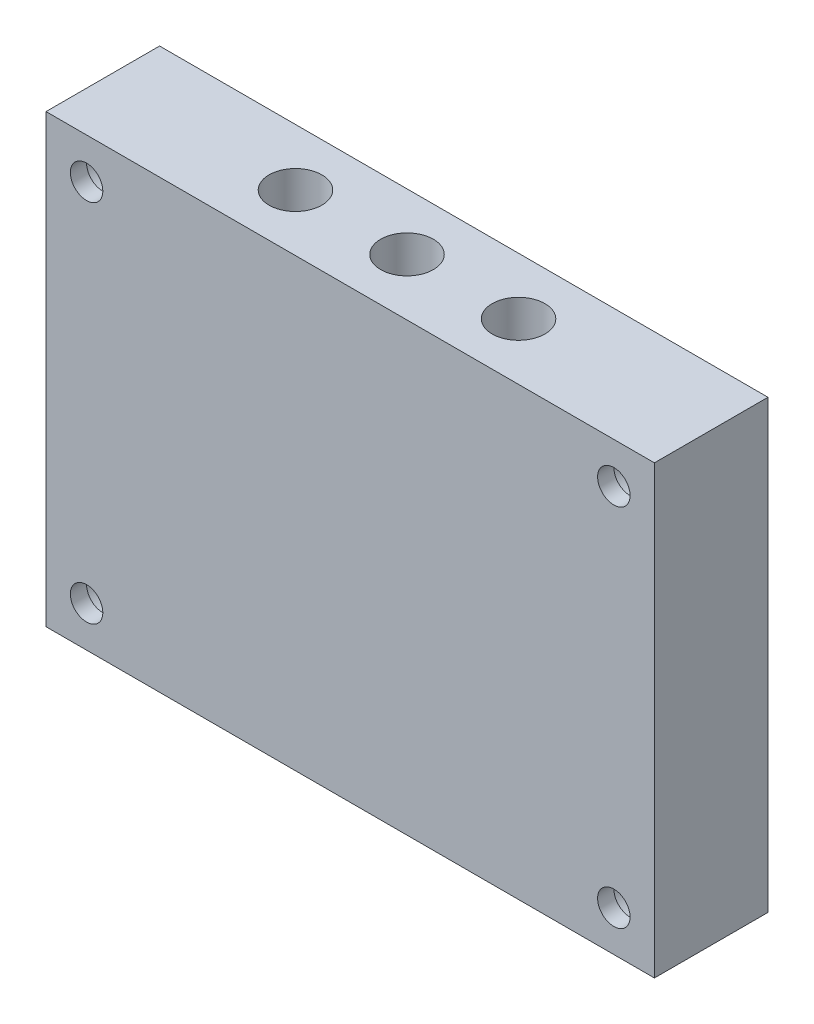
ISO-10303-21;
HEADER;
FILE_DESCRIPTION(('STEP AP214'),'2;1');
FILE_NAME('part.step','',(''),(''),'','','');
FILE_SCHEMA(('AUTOMOTIVE_DESIGN { 1 0 10303 214 1 1 1 1 }'));
ENDSEC;
DATA;
#1=APPLICATION_CONTEXT('core data for automotive mechanical design processes');
#2=APPLICATION_PROTOCOL_DEFINITION('international standard','automotive_design',2000,#1);
#3=PRODUCT_CONTEXT('',#1,'mechanical');
#4=PRODUCT('Part','Part','',(#3));
#5=PRODUCT_RELATED_PRODUCT_CATEGORY('part','',(#4));
#6=PRODUCT_DEFINITION_FORMATION('','',#4);
#7=PRODUCT_DEFINITION_CONTEXT('part definition',#1,'design');
#8=PRODUCT_DEFINITION('design','',#6,#7);
#9=PRODUCT_DEFINITION_SHAPE('','',#8);
#10=(LENGTH_UNIT() NAMED_UNIT(*) SI_UNIT(.MILLI.,.METRE.));
#11=(NAMED_UNIT(*) PLANE_ANGLE_UNIT() SI_UNIT($,.RADIAN.));
#12=(NAMED_UNIT(*) SI_UNIT($,.STERADIAN.) SOLID_ANGLE_UNIT());
#13=UNCERTAINTY_MEASURE_WITH_UNIT(LENGTH_MEASURE(1.E-05),#10,'distance_accuracy_value','');
#14=(GEOMETRIC_REPRESENTATION_CONTEXT(3) GLOBAL_UNCERTAINTY_ASSIGNED_CONTEXT((#13)) GLOBAL_UNIT_ASSIGNED_CONTEXT((#10,
#11,#12)) REPRESENTATION_CONTEXT('',''));
#15=CARTESIAN_POINT('',(0.,0.,0.));
#16=DIRECTION('',(0.,0.,1.));
#17=DIRECTION('',(1.,0.,0.));
#18=AXIS2_PLACEMENT_3D('',#15,#16,#17);
#19=CARTESIAN_POINT('',(-23.75,-55.,7.));
#20=DIRECTION('',(0.,1.,0.));
#21=DIRECTION('',(0.,0.,1.));
#22=AXIS2_PLACEMENT_3D('',#19,#20,#21);
#23=CYLINDRICAL_SURFACE('',#22,1.32);
#24=CARTESIAN_POINT('',(-23.75,-10.,7.));
#25=DIRECTION('',(0.,-1.,0.));
#26=DIRECTION('',(0.,0.,-1.));
#27=AXIS2_PLACEMENT_3D('',#24,#25,#26);
#28=CIRCLE('',#27,1.32);
#29=CARTESIAN_POINT('',(-23.75,-10.,5.68));
#30=VERTEX_POINT('',#29);
#31=EDGE_CURVE('E175',#30,#30,#28,.T.);
#32=ORIENTED_EDGE('',*,*,#31,.T.);
#33=EDGE_LOOP('',(#32));
#34=FACE_BOUND('',#33,.T.);
#35=CARTESIAN_POINT('',(-23.75,-8.00000000000001,7.));
#36=DIRECTION('',(0.,1.,0.));
#37=DIRECTION('',(-1.,0.,0.));
#38=AXIS2_PLACEMENT_3D('',#35,#36,#37);
#39=CIRCLE('',#38,1.32);
#40=CARTESIAN_POINT('',(-25.07,-8.00000000000001,7.));
#41=VERTEX_POINT('',#40);
#42=EDGE_CURVE('E194',#41,#41,#39,.F.);
#43=ORIENTED_EDGE('',*,*,#42,.F.);
#44=EDGE_LOOP('',(#43));
#45=FACE_BOUND('',#44,.T.);
#46=ADVANCED_FACE('F33',(#34,#45),#23,.F.);
#47=CARTESIAN_POINT('',(-37.5,-55.,7.));
#48=DIRECTION('',(0.,1.,0.));
#49=DIRECTION('',(0.,0.,1.));
#50=AXIS2_PLACEMENT_3D('',#47,#48,#49);
#51=CYLINDRICAL_SURFACE('',#50,1.32);
#52=CARTESIAN_POINT('',(-37.5,-10.,7.));
#53=DIRECTION('',(0.,-1.,0.));
#54=DIRECTION('',(0.,0.,-1.));
#55=AXIS2_PLACEMENT_3D('',#52,#53,#54);
#56=CIRCLE('',#55,1.32);
#57=CARTESIAN_POINT('',(-37.5,-10.,5.68));
#58=VERTEX_POINT('',#57);
#59=EDGE_CURVE('E180',#58,#58,#56,.T.);
#60=ORIENTED_EDGE('',*,*,#59,.T.);
#61=EDGE_LOOP('',(#60));
#62=FACE_BOUND('',#61,.T.);
#63=CARTESIAN_POINT('',(-37.5,-8.00000000000001,7.));
#64=DIRECTION('',(0.,1.,0.));
#65=DIRECTION('',(-1.,0.,0.));
#66=AXIS2_PLACEMENT_3D('',#63,#64,#65);
#67=CIRCLE('',#66,1.32);
#68=CARTESIAN_POINT('',(-38.82,-8.00000000000001,7.));
#69=VERTEX_POINT('',#68);
#70=EDGE_CURVE('E189',#69,#69,#67,.F.);
#71=ORIENTED_EDGE('',*,*,#70,.F.);
#72=EDGE_LOOP('',(#71));
#73=FACE_BOUND('',#72,.T.);
#74=ADVANCED_FACE('F289',(#62,#73),#51,.F.);
#75=CARTESIAN_POINT('',(-51.25,-55.,7.));
#76=DIRECTION('',(0.,1.,0.));
#77=DIRECTION('',(0.,0.,1.));
#78=AXIS2_PLACEMENT_3D('',#75,#76,#77);
#79=CYLINDRICAL_SURFACE('',#78,1.32);
#80=CARTESIAN_POINT('',(-51.25,-10.,7.));
#81=DIRECTION('',(0.,-1.,0.));
#82=DIRECTION('',(0.,0.,-1.));
#83=AXIS2_PLACEMENT_3D('',#80,#81,#82);
#84=CIRCLE('',#83,1.32);
#85=CARTESIAN_POINT('',(-51.25,-10.,5.68));
#86=VERTEX_POINT('',#85);
#87=EDGE_CURVE('E127',#86,#86,#84,.T.);
#88=ORIENTED_EDGE('',*,*,#87,.T.);
#89=EDGE_LOOP('',(#88));
#90=FACE_BOUND('',#89,.T.);
#91=CARTESIAN_POINT('',(-51.25,-8.00000000000001,7.));
#92=DIRECTION('',(0.,1.,0.));
#93=DIRECTION('',(-1.,0.,0.));
#94=AXIS2_PLACEMENT_3D('',#91,#92,#93);
#95=CIRCLE('',#94,1.32);
#96=CARTESIAN_POINT('',(-52.57,-8.00000000000001,7.));
#97=VERTEX_POINT('',#96);
#98=EDGE_CURVE('E185',#97,#97,#95,.F.);
#99=ORIENTED_EDGE('',*,*,#98,.F.);
#100=EDGE_LOOP('',(#99));
#101=FACE_BOUND('',#100,.T.);
#102=ADVANCED_FACE('F276',(#90,#101),#79,.F.);
#103=CARTESIAN_POINT('',(0.,0.,0.));
#104=DIRECTION('',(0.,0.,-1.));
#105=DIRECTION('',(-1.,0.,0.));
#106=AXIS2_PLACEMENT_3D('',#103,#104,#105);
#107=PLANE('',#106);
#108=CARTESIAN_POINT('',(-5.,-50.,0.));
#109=DIRECTION('',(0.,0.,-1.));
#110=DIRECTION('',(-1.,0.,0.));
#111=AXIS2_PLACEMENT_3D('',#108,#109,#110);
#112=CIRCLE('',#111,3.25);
#113=CARTESIAN_POINT('',(-8.25,-50.,0.));
#114=VERTEX_POINT('',#113);
#115=EDGE_CURVE('E202',#114,#114,#112,.T.);
#116=ORIENTED_EDGE('',*,*,#115,.F.);
#117=EDGE_LOOP('',(#116));
#118=FACE_BOUND('',#117,.T.);
#119=CARTESIAN_POINT('',(-70.,-50.,0.));
#120=DIRECTION('',(0.,0.,-1.));
#121=DIRECTION('',(-1.,0.,0.));
#122=AXIS2_PLACEMENT_3D('',#119,#120,#121);
#123=CIRCLE('',#122,3.24999999999999);
#124=CARTESIAN_POINT('',(-73.25,-50.,0.));
#125=VERTEX_POINT('',#124);
#126=EDGE_CURVE('E227',#125,#125,#123,.T.);
#127=ORIENTED_EDGE('',*,*,#126,.F.);
#128=EDGE_LOOP('',(#127));
#129=FACE_BOUND('',#128,.T.);
#130=CARTESIAN_POINT('',(-70.,-5.,0.));
#131=DIRECTION('',(0.,0.,-1.));
#132=DIRECTION('',(-1.,0.,0.));
#133=AXIS2_PLACEMENT_3D('',#130,#131,#132);
#134=CIRCLE('',#133,3.24999999999999);
#135=CARTESIAN_POINT('',(-73.25,-5.,0.));
#136=VERTEX_POINT('',#135);
#137=EDGE_CURVE('E233',#136,#136,#134,.T.);
#138=ORIENTED_EDGE('',*,*,#137,.F.);
#139=EDGE_LOOP('',(#138));
#140=FACE_BOUND('',#139,.T.);
#141=CARTESIAN_POINT('',(-5.,-5.,0.));
#142=DIRECTION('',(0.,0.,-1.));
#143=DIRECTION('',(-1.,0.,0.));
#144=AXIS2_PLACEMENT_3D('',#141,#142,#143);
#145=CIRCLE('',#144,3.25);
#146=CARTESIAN_POINT('',(-8.25,-5.,0.));
#147=VERTEX_POINT('',#146);
#148=EDGE_CURVE('E239',#147,#147,#145,.T.);
#149=ORIENTED_EDGE('',*,*,#148,.F.);
#150=EDGE_LOOP('',(#149));
#151=FACE_BOUND('',#150,.T.);
#152=DIRECTION('',(0.,1.,0.));
#153=VECTOR('',#152,1.);
#154=CARTESIAN_POINT('',(0.,0.,0.));
#155=LINE('',#154,#153);
#156=CARTESIAN_POINT('',(0.,-55.,0.));
#157=VERTEX_POINT('',#156);
#158=CARTESIAN_POINT('',(0.,0.,0.));
#159=VERTEX_POINT('',#158);
#160=EDGE_CURVE('E163',#157,#159,#155,.T.);
#161=ORIENTED_EDGE('',*,*,#160,.F.);
#162=DIRECTION('',(1.,0.,0.));
#163=VECTOR('',#162,1.);
#164=CARTESIAN_POINT('',(0.,-55.,0.));
#165=LINE('',#164,#163);
#166=CARTESIAN_POINT('',(-75.,-55.,0.));
#167=VERTEX_POINT('',#166);
#168=EDGE_CURVE('E58',#167,#157,#165,.T.);
#169=ORIENTED_EDGE('',*,*,#168,.F.);
#170=DIRECTION('',(0.,-1.,0.));
#171=VECTOR('',#170,1.);
#172=CARTESIAN_POINT('',(-75.,0.,0.));
#173=LINE('',#172,#171);
#174=CARTESIAN_POINT('',(-75.,0.,0.));
#175=VERTEX_POINT('',#174);
#176=EDGE_CURVE('E109',#175,#167,#173,.T.);
#177=ORIENTED_EDGE('',*,*,#176,.F.);
#178=DIRECTION('',(-1.,0.,0.));
#179=VECTOR('',#178,1.);
#180=CARTESIAN_POINT('',(0.,0.,0.));
#181=LINE('',#180,#179);
#182=EDGE_CURVE('E166',#159,#175,#181,.T.);
#183=ORIENTED_EDGE('',*,*,#182,.F.);
#184=EDGE_LOOP('',(#161,#169,#177,#183));
#185=FACE_BOUND('',#184,.T.);
#186=DIRECTION('',(-1.,0.,0.));
#187=VECTOR('',#186,1.);
#188=CARTESIAN_POINT('',(-65.,-10.,0.));
#189=LINE('',#188,#187);
#190=CARTESIAN_POINT('',(-10.,-10.,0.));
#191=VERTEX_POINT('',#190);
#192=CARTESIAN_POINT('',(-65.,-10.,0.));
#193=VERTEX_POINT('',#192);
#194=EDGE_CURVE('E137',#191,#193,#189,.T.);
#195=ORIENTED_EDGE('',*,*,#194,.T.);
#196=DIRECTION('',(0.,-1.,0.));
#197=VECTOR('',#196,1.);
#198=CARTESIAN_POINT('',(-65.,-10.,0.));
#199=LINE('',#198,#197);
#200=CARTESIAN_POINT('',(-65.,-45.,0.));
#201=VERTEX_POINT('',#200);
#202=EDGE_CURVE('E50',#193,#201,#199,.T.);
#203=ORIENTED_EDGE('',*,*,#202,.T.);
#204=DIRECTION('',(1.,0.,0.));
#205=VECTOR('',#204,1.);
#206=CARTESIAN_POINT('',(-65.,-45.,0.));
#207=LINE('',#206,#205);
#208=CARTESIAN_POINT('',(-9.99999999999999,-45.,0.));
#209=VERTEX_POINT('',#208);
#210=EDGE_CURVE('E148',#201,#209,#207,.T.);
#211=ORIENTED_EDGE('',*,*,#210,.T.);
#212=DIRECTION('',(0.,1.,0.));
#213=VECTOR('',#212,1.);
#214=CARTESIAN_POINT('',(-10.,-10.,0.));
#215=LINE('',#214,#213);
#216=EDGE_CURVE('E151',#209,#191,#215,.T.);
#217=ORIENTED_EDGE('',*,*,#216,.T.);
#218=EDGE_LOOP('',(#195,#203,#211,#217));
#219=FACE_BOUND('',#218,.T.);
#220=ADVANCED_FACE('F288',(#118,#129,#140,#151,#185,#219),#107,.T.);
#221=CARTESIAN_POINT('',(0.,0.,12.));
#222=DIRECTION('',(-1.,0.,0.));
#223=DIRECTION('',(0.,-1.,0.));
#224=AXIS2_PLACEMENT_3D('',#221,#222,#223);
#225=PLANE('',#224);
#226=ORIENTED_EDGE('',*,*,#160,.T.);
#227=DIRECTION('',(0.,0.,-1.));
#228=VECTOR('',#227,1.);
#229=CARTESIAN_POINT('',(0.,0.,12.));
#230=LINE('',#229,#228);
#231=CARTESIAN_POINT('',(0.,0.,14.));
#232=VERTEX_POINT('',#231);
#233=EDGE_CURVE('E11',#232,#159,#230,.T.);
#234=ORIENTED_EDGE('',*,*,#233,.F.);
#235=DIRECTION('',(0.,1.,0.));
#236=VECTOR('',#235,1.);
#237=CARTESIAN_POINT('',(0.,0.,14.));
#238=LINE('',#237,#236);
#239=CARTESIAN_POINT('',(0.,-55.,14.));
#240=VERTEX_POINT('',#239);
#241=EDGE_CURVE('E118',#240,#232,#238,.T.);
#242=ORIENTED_EDGE('',*,*,#241,.F.);
#243=DIRECTION('',(0.,0.,-1.));
#244=VECTOR('',#243,1.);
#245=CARTESIAN_POINT('',(0.,-55.,12.));
#246=LINE('',#245,#244);
#247=EDGE_CURVE('E110',#240,#157,#246,.T.);
#248=ORIENTED_EDGE('',*,*,#247,.T.);
#249=EDGE_LOOP('',(#226,#234,#242,#248));
#250=FACE_BOUND('',#249,.T.);
#251=ADVANCED_FACE('F35',(#250),#225,.F.);
#252=CARTESIAN_POINT('',(0.,0.,12.));
#253=DIRECTION('',(0.,-1.,0.));
#254=DIRECTION('',(1.,0.,0.));
#255=AXIS2_PLACEMENT_3D('',#252,#253,#254);
#256=PLANE('',#255);
#257=CARTESIAN_POINT('',(-23.75,0.,7.));
#258=DIRECTION('',(0.,1.,0.));
#259=DIRECTION('',(-1.,0.,0.));
#260=AXIS2_PLACEMENT_3D('',#257,#258,#259);
#261=CIRCLE('',#260,3.25);
#262=CARTESIAN_POINT('',(-27.,0.,7.));
#263=VERTEX_POINT('',#262);
#264=EDGE_CURVE('E245',#263,#263,#261,.T.);
#265=ORIENTED_EDGE('',*,*,#264,.F.);
#266=EDGE_LOOP('',(#265));
#267=FACE_BOUND('',#266,.T.);
#268=CARTESIAN_POINT('',(-37.5,0.,7.));
#269=DIRECTION('',(0.,1.,0.));
#270=DIRECTION('',(-1.,0.,0.));
#271=AXIS2_PLACEMENT_3D('',#268,#269,#270);
#272=CIRCLE('',#271,3.25);
#273=CARTESIAN_POINT('',(-40.75,0.,7.));
#274=VERTEX_POINT('',#273);
#275=EDGE_CURVE('E197',#274,#274,#272,.T.);
#276=ORIENTED_EDGE('',*,*,#275,.F.);
#277=EDGE_LOOP('',(#276));
#278=FACE_BOUND('',#277,.T.);
#279=CARTESIAN_POINT('',(-51.25,0.,7.));
#280=DIRECTION('',(0.,1.,0.));
#281=DIRECTION('',(-1.,0.,0.));
#282=AXIS2_PLACEMENT_3D('',#279,#280,#281);
#283=CIRCLE('',#282,3.25);
#284=CARTESIAN_POINT('',(-54.5,0.,7.));
#285=VERTEX_POINT('',#284);
#286=EDGE_CURVE('E192',#285,#285,#283,.T.);
#287=ORIENTED_EDGE('',*,*,#286,.F.);
#288=EDGE_LOOP('',(#287));
#289=FACE_BOUND('',#288,.T.);
#290=ORIENTED_EDGE('',*,*,#182,.T.);
#291=DIRECTION('',(0.,0.,-1.));
#292=VECTOR('',#291,1.);
#293=CARTESIAN_POINT('',(-75.,0.,12.));
#294=LINE('',#293,#292);
#295=CARTESIAN_POINT('',(-75.,0.,14.));
#296=VERTEX_POINT('',#295);
#297=EDGE_CURVE('E42',#296,#175,#294,.T.);
#298=ORIENTED_EDGE('',*,*,#297,.F.);
#299=DIRECTION('',(-1.,0.,0.));
#300=VECTOR('',#299,1.);
#301=CARTESIAN_POINT('',(-75.,0.,14.));
#302=LINE('',#301,#300);
#303=EDGE_CURVE('E123',#232,#296,#302,.T.);
#304=ORIENTED_EDGE('',*,*,#303,.F.);
#305=ORIENTED_EDGE('',*,*,#233,.T.);
#306=EDGE_LOOP('',(#290,#298,#304,#305));
#307=FACE_BOUND('',#306,.T.);
#308=ADVANCED_FACE('F430',(#267,#278,#289,#307),#256,.F.);
#309=CARTESIAN_POINT('',(-75.,0.,12.));
#310=DIRECTION('',(1.,0.,0.));
#311=DIRECTION('',(0.,0.,-1.));
#312=AXIS2_PLACEMENT_3D('',#309,#310,#311);
#313=PLANE('',#312);
#314=ORIENTED_EDGE('',*,*,#176,.T.);
#315=DIRECTION('',(0.,0.,-1.));
#316=VECTOR('',#315,1.);
#317=CARTESIAN_POINT('',(-75.,-55.,12.));
#318=LINE('',#317,#316);
#319=CARTESIAN_POINT('',(-75.,-55.,14.));
#320=VERTEX_POINT('',#319);
#321=EDGE_CURVE('E102',#320,#167,#318,.T.);
#322=ORIENTED_EDGE('',*,*,#321,.F.);
#323=DIRECTION('',(0.,-1.,0.));
#324=VECTOR('',#323,1.);
#325=CARTESIAN_POINT('',(-75.,0.,14.));
#326=LINE('',#325,#324);
#327=EDGE_CURVE('E107',#296,#320,#326,.T.);
#328=ORIENTED_EDGE('',*,*,#327,.F.);
#329=ORIENTED_EDGE('',*,*,#297,.T.);
#330=EDGE_LOOP('',(#314,#322,#328,#329));
#331=FACE_BOUND('',#330,.T.);
#332=ADVANCED_FACE('F104',(#331),#313,.F.);
#333=CARTESIAN_POINT('',(0.,-55.,12.));
#334=DIRECTION('',(0.,1.,0.));
#335=DIRECTION('',(-1.,0.,0.));
#336=AXIS2_PLACEMENT_3D('',#333,#334,#335);
#337=PLANE('',#336);
#338=CARTESIAN_POINT('',(-37.5,-55.,7.));
#339=DIRECTION('',(0.,1.,0.));
#340=DIRECTION('',(0.,0.,1.));
#341=AXIS2_PLACEMENT_3D('',#338,#339,#340);
#342=CIRCLE('',#341,1.32);
#343=CARTESIAN_POINT('',(-37.5,-55.,8.32));
#344=VERTEX_POINT('',#343);
#345=EDGE_CURVE('E184',#344,#344,#342,.T.);
#346=ORIENTED_EDGE('',*,*,#345,.T.);
#347=EDGE_LOOP('',(#346));
#348=FACE_BOUND('',#347,.T.);
#349=CARTESIAN_POINT('',(-23.75,-55.,7.));
#350=DIRECTION('',(0.,1.,0.));
#351=DIRECTION('',(0.,0.,1.));
#352=AXIS2_PLACEMENT_3D('',#349,#350,#351);
#353=CIRCLE('',#352,1.32);
#354=CARTESIAN_POINT('',(-23.75,-55.,8.32));
#355=VERTEX_POINT('',#354);
#356=EDGE_CURVE('E179',#355,#355,#353,.T.);
#357=ORIENTED_EDGE('',*,*,#356,.T.);
#358=EDGE_LOOP('',(#357));
#359=FACE_BOUND('',#358,.T.);
#360=CARTESIAN_POINT('',(-51.25,-55.,7.));
#361=DIRECTION('',(0.,1.,0.));
#362=DIRECTION('',(0.,0.,1.));
#363=AXIS2_PLACEMENT_3D('',#360,#361,#362);
#364=CIRCLE('',#363,1.32);
#365=CARTESIAN_POINT('',(-51.25,-55.,8.32));
#366=VERTEX_POINT('',#365);
#367=EDGE_CURVE('E174',#366,#366,#364,.T.);
#368=ORIENTED_EDGE('',*,*,#367,.T.);
#369=EDGE_LOOP('',(#368));
#370=FACE_BOUND('',#369,.T.);
#371=ORIENTED_EDGE('',*,*,#168,.T.);
#372=ORIENTED_EDGE('',*,*,#247,.F.);
#373=DIRECTION('',(1.,0.,0.));
#374=VECTOR('',#373,1.);
#375=CARTESIAN_POINT('',(-75.,-55.,14.));
#376=LINE('',#375,#374);
#377=EDGE_CURVE('E113',#320,#240,#376,.T.);
#378=ORIENTED_EDGE('',*,*,#377,.F.);
#379=ORIENTED_EDGE('',*,*,#321,.T.);
#380=EDGE_LOOP('',(#371,#372,#378,#379));
#381=FACE_BOUND('',#380,.T.);
#382=ADVANCED_FACE('F114',(#348,#359,#370,#381),#337,.F.);
#383=CARTESIAN_POINT('',(-65.,-10.,12.));
#384=DIRECTION('',(1.,0.,0.));
#385=DIRECTION('',(0.,0.,-1.));
#386=AXIS2_PLACEMENT_3D('',#383,#384,#385);
#387=PLANE('',#386);
#388=ORIENTED_EDGE('',*,*,#202,.F.);
#389=DIRECTION('',(0.,0.,-1.));
#390=VECTOR('',#389,1.);
#391=CARTESIAN_POINT('',(-65.,-10.,12.));
#392=LINE('',#391,#390);
#393=CARTESIAN_POINT('',(-65.,-10.,12.));
#394=VERTEX_POINT('',#393);
#395=EDGE_CURVE('E146',#394,#193,#392,.T.);
#396=ORIENTED_EDGE('',*,*,#395,.F.);
#397=DIRECTION('',(0.,-1.,0.));
#398=VECTOR('',#397,1.);
#399=CARTESIAN_POINT('',(-65.,-10.,12.));
#400=LINE('',#399,#398);
#401=CARTESIAN_POINT('',(-65.,-45.,12.));
#402=VERTEX_POINT('',#401);
#403=EDGE_CURVE('E133',#394,#402,#400,.T.);
#404=ORIENTED_EDGE('',*,*,#403,.T.);
#405=DIRECTION('',(0.,0.,-1.));
#406=VECTOR('',#405,1.);
#407=CARTESIAN_POINT('',(-65.,-45.,12.));
#408=LINE('',#407,#406);
#409=EDGE_CURVE('E161',#402,#201,#408,.T.);
#410=ORIENTED_EDGE('',*,*,#409,.T.);
#411=EDGE_LOOP('',(#388,#396,#404,#410));
#412=FACE_BOUND('',#411,.T.);
#413=ADVANCED_FACE('F403',(#412),#387,.T.);
#414=CARTESIAN_POINT('',(-65.,-45.,12.));
#415=DIRECTION('',(0.,1.,0.));
#416=DIRECTION('',(0.,0.,1.));
#417=AXIS2_PLACEMENT_3D('',#414,#415,#416);
#418=PLANE('',#417);
#419=CARTESIAN_POINT('',(-37.5,-45.,7.));
#420=DIRECTION('',(0.,1.,0.));
#421=DIRECTION('',(0.,0.,1.));
#422=AXIS2_PLACEMENT_3D('',#419,#420,#421);
#423=CIRCLE('',#422,1.32);
#424=CARTESIAN_POINT('',(-37.5,-45.,8.32));
#425=VERTEX_POINT('',#424);
#426=EDGE_CURVE('E183',#425,#425,#423,.T.);
#427=ORIENTED_EDGE('',*,*,#426,.F.);
#428=EDGE_LOOP('',(#427));
#429=FACE_BOUND('',#428,.T.);
#430=CARTESIAN_POINT('',(-23.75,-45.,7.));
#431=DIRECTION('',(0.,1.,0.));
#432=DIRECTION('',(0.,0.,1.));
#433=AXIS2_PLACEMENT_3D('',#430,#431,#432);
#434=CIRCLE('',#433,1.32);
#435=CARTESIAN_POINT('',(-23.75,-45.,8.32));
#436=VERTEX_POINT('',#435);
#437=EDGE_CURVE('E178',#436,#436,#434,.T.);
#438=ORIENTED_EDGE('',*,*,#437,.F.);
#439=EDGE_LOOP('',(#438));
#440=FACE_BOUND('',#439,.T.);
#441=CARTESIAN_POINT('',(-51.25,-45.,7.));
#442=DIRECTION('',(0.,1.,0.));
#443=DIRECTION('',(0.,0.,1.));
#444=AXIS2_PLACEMENT_3D('',#441,#442,#443);
#445=CIRCLE('',#444,1.32);
#446=CARTESIAN_POINT('',(-51.25,-45.,8.32));
#447=VERTEX_POINT('',#446);
#448=EDGE_CURVE('E124',#447,#447,#445,.T.);
#449=ORIENTED_EDGE('',*,*,#448,.F.);
#450=EDGE_LOOP('',(#449));
#451=FACE_BOUND('',#450,.T.);
#452=ORIENTED_EDGE('',*,*,#210,.F.);
#453=ORIENTED_EDGE('',*,*,#409,.F.);
#454=DIRECTION('',(1.,0.,0.));
#455=VECTOR('',#454,1.);
#456=CARTESIAN_POINT('',(-65.,-45.,12.));
#457=LINE('',#456,#455);
#458=CARTESIAN_POINT('',(-9.99999999999999,-45.,12.));
#459=VERTEX_POINT('',#458);
#460=EDGE_CURVE('E136',#402,#459,#457,.T.);
#461=ORIENTED_EDGE('',*,*,#460,.T.);
#462=DIRECTION('',(0.,0.,-1.));
#463=VECTOR('',#462,1.);
#464=CARTESIAN_POINT('',(-9.99999999999999,-45.,12.));
#465=LINE('',#464,#463);
#466=EDGE_CURVE('E159',#459,#209,#465,.T.);
#467=ORIENTED_EDGE('',*,*,#466,.T.);
#468=EDGE_LOOP('',(#452,#453,#461,#467));
#469=FACE_BOUND('',#468,.T.);
#470=ADVANCED_FACE('F407',(#429,#440,#451,#469),#418,.T.);
#471=CARTESIAN_POINT('',(-10.,-10.,12.));
#472=DIRECTION('',(-1.,0.,0.));
#473=DIRECTION('',(0.,-1.,0.));
#474=AXIS2_PLACEMENT_3D('',#471,#472,#473);
#475=PLANE('',#474);
#476=ORIENTED_EDGE('',*,*,#216,.F.);
#477=ORIENTED_EDGE('',*,*,#466,.F.);
#478=DIRECTION('',(0.,1.,0.));
#479=VECTOR('',#478,1.);
#480=CARTESIAN_POINT('',(-10.,-10.,12.));
#481=LINE('',#480,#479);
#482=CARTESIAN_POINT('',(-10.,-10.,12.));
#483=VERTEX_POINT('',#482);
#484=EDGE_CURVE('E140',#459,#483,#481,.T.);
#485=ORIENTED_EDGE('',*,*,#484,.T.);
#486=DIRECTION('',(0.,0.,-1.));
#487=VECTOR('',#486,1.);
#488=CARTESIAN_POINT('',(-10.,-10.,12.));
#489=LINE('',#488,#487);
#490=EDGE_CURVE('E157',#483,#191,#489,.T.);
#491=ORIENTED_EDGE('',*,*,#490,.T.);
#492=EDGE_LOOP('',(#476,#477,#485,#491));
#493=FACE_BOUND('',#492,.T.);
#494=ADVANCED_FACE('F410',(#493),#475,.T.);
#495=CARTESIAN_POINT('',(-65.,-10.,12.));
#496=DIRECTION('',(0.,-1.,0.));
#497=DIRECTION('',(0.,0.,-1.));
#498=AXIS2_PLACEMENT_3D('',#495,#496,#497);
#499=PLANE('',#498);
#500=ORIENTED_EDGE('',*,*,#59,.F.);
#501=EDGE_LOOP('',(#500));
#502=FACE_BOUND('',#501,.T.);
#503=ORIENTED_EDGE('',*,*,#31,.F.);
#504=EDGE_LOOP('',(#503));
#505=FACE_BOUND('',#504,.T.);
#506=ORIENTED_EDGE('',*,*,#87,.F.);
#507=EDGE_LOOP('',(#506));
#508=FACE_BOUND('',#507,.T.);
#509=ORIENTED_EDGE('',*,*,#194,.F.);
#510=ORIENTED_EDGE('',*,*,#490,.F.);
#511=DIRECTION('',(-1.,0.,0.));
#512=VECTOR('',#511,1.);
#513=CARTESIAN_POINT('',(-65.,-10.,12.));
#514=LINE('',#513,#512);
#515=EDGE_CURVE('E143',#483,#394,#514,.T.);
#516=ORIENTED_EDGE('',*,*,#515,.T.);
#517=ORIENTED_EDGE('',*,*,#395,.T.);
#518=EDGE_LOOP('',(#509,#510,#516,#517));
#519=FACE_BOUND('',#518,.T.);
#520=ADVANCED_FACE('F402',(#502,#505,#508,#519),#499,.T.);
#521=CARTESIAN_POINT('',(0.,0.,12.));
#522=DIRECTION('',(0.,0.,1.));
#523=DIRECTION('',(1.,0.,0.));
#524=AXIS2_PLACEMENT_3D('',#521,#522,#523);
#525=PLANE('',#524);
#526=ORIENTED_EDGE('',*,*,#403,.F.);
#527=ORIENTED_EDGE('',*,*,#515,.F.);
#528=ORIENTED_EDGE('',*,*,#484,.F.);
#529=ORIENTED_EDGE('',*,*,#460,.F.);
#530=EDGE_LOOP('',(#526,#527,#528,#529));
#531=FACE_BOUND('',#530,.T.);
#532=ADVANCED_FACE('F284',(#531),#525,.F.);
#533=CARTESIAN_POINT('',(0.,0.,14.));
#534=DIRECTION('',(0.,0.,1.));
#535=DIRECTION('',(1.,0.,0.));
#536=AXIS2_PLACEMENT_3D('',#533,#534,#535);
#537=PLANE('',#536);
#538=CARTESIAN_POINT('',(-5.00000000000047,-50.,14.));
#539=DIRECTION('',(0.,0.,-1.));
#540=DIRECTION('',(-1.,0.,0.));
#541=AXIS2_PLACEMENT_3D('',#538,#539,#540);
#542=CIRCLE('',#541,2.);
#543=CARTESIAN_POINT('',(-7.00000000000047,-50.,14.));
#544=VERTEX_POINT('',#543);
#545=EDGE_CURVE('E219',#544,#544,#542,.T.);
#546=ORIENTED_EDGE('',*,*,#545,.T.);
#547=EDGE_LOOP('',(#546));
#548=FACE_BOUND('',#547,.T.);
#549=CARTESIAN_POINT('',(-70.0000000000005,-50.,14.));
#550=DIRECTION('',(0.,0.,-1.));
#551=DIRECTION('',(-1.,0.,0.));
#552=AXIS2_PLACEMENT_3D('',#549,#550,#551);
#553=CIRCLE('',#552,2.);
#554=CARTESIAN_POINT('',(-72.0000000000005,-50.,14.));
#555=VERTEX_POINT('',#554);
#556=EDGE_CURVE('E209',#555,#555,#553,.T.);
#557=ORIENTED_EDGE('',*,*,#556,.T.);
#558=EDGE_LOOP('',(#557));
#559=FACE_BOUND('',#558,.T.);
#560=CARTESIAN_POINT('',(-70.,-5.,14.));
#561=DIRECTION('',(0.,0.,-1.));
#562=DIRECTION('',(-1.,0.,0.));
#563=AXIS2_PLACEMENT_3D('',#560,#561,#562);
#564=CIRCLE('',#563,2.);
#565=CARTESIAN_POINT('',(-72.,-5.,14.));
#566=VERTEX_POINT('',#565);
#567=EDGE_CURVE('E206',#566,#566,#564,.T.);
#568=ORIENTED_EDGE('',*,*,#567,.T.);
#569=EDGE_LOOP('',(#568));
#570=FACE_BOUND('',#569,.T.);
#571=CARTESIAN_POINT('',(-5.,-5.,14.));
#572=DIRECTION('',(0.,0.,-1.));
#573=DIRECTION('',(-1.,0.,0.));
#574=AXIS2_PLACEMENT_3D('',#571,#572,#573);
#575=CIRCLE('',#574,2.);
#576=CARTESIAN_POINT('',(-7.,-5.,14.));
#577=VERTEX_POINT('',#576);
#578=EDGE_CURVE('E203',#577,#577,#575,.T.);
#579=ORIENTED_EDGE('',*,*,#578,.T.);
#580=EDGE_LOOP('',(#579));
#581=FACE_BOUND('',#580,.T.);
#582=ORIENTED_EDGE('',*,*,#327,.T.);
#583=ORIENTED_EDGE('',*,*,#377,.T.);
#584=ORIENTED_EDGE('',*,*,#241,.T.);
#585=ORIENTED_EDGE('',*,*,#303,.T.);
#586=EDGE_LOOP('',(#582,#583,#584,#585));
#587=FACE_BOUND('',#586,.T.);
#588=ADVANCED_FACE('F121',(#548,#559,#570,#581,#587),#537,.T.);
#589=ORIENTED_EDGE('',*,*,#448,.T.);
#590=EDGE_LOOP('',(#589));
#591=FACE_BOUND('',#590,.T.);
#592=ORIENTED_EDGE('',*,*,#367,.F.);
#593=EDGE_LOOP('',(#592));
#594=FACE_BOUND('',#593,.T.);
#595=ADVANCED_FACE('F271',(#591,#594),#79,.F.);
#596=ORIENTED_EDGE('',*,*,#437,.T.);
#597=EDGE_LOOP('',(#596));
#598=FACE_BOUND('',#597,.T.);
#599=ORIENTED_EDGE('',*,*,#356,.F.);
#600=EDGE_LOOP('',(#599));
#601=FACE_BOUND('',#600,.T.);
#602=ADVANCED_FACE('F273',(#598,#601),#23,.F.);
#603=ORIENTED_EDGE('',*,*,#426,.T.);
#604=EDGE_LOOP('',(#603));
#605=FACE_BOUND('',#604,.T.);
#606=ORIENTED_EDGE('',*,*,#345,.F.);
#607=EDGE_LOOP('',(#606));
#608=FACE_BOUND('',#607,.T.);
#609=ADVANCED_FACE('F281',(#605,#608),#51,.F.);
#610=CARTESIAN_POINT('',(-51.25,-8.00000000000001,7.));
#611=DIRECTION('',(0.,1.,0.));
#612=DIRECTION('',(-1.,0.,0.));
#613=AXIS2_PLACEMENT_3D('',#610,#611,#612);
#614=PLANE('',#613);
#615=CARTESIAN_POINT('',(-51.25,-8.00000000000001,7.));
#616=DIRECTION('',(0.,1.,0.));
#617=DIRECTION('',(-1.,0.,0.));
#618=AXIS2_PLACEMENT_3D('',#615,#616,#617);
#619=CIRCLE('',#618,3.25);
#620=CARTESIAN_POINT('',(-54.5,-8.00000000000001,7.));
#621=VERTEX_POINT('',#620);
#622=EDGE_CURVE('E188',#621,#621,#619,.T.);
#623=ORIENTED_EDGE('',*,*,#622,.T.);
#624=EDGE_LOOP('',(#623));
#625=FACE_BOUND('',#624,.T.);
#626=ORIENTED_EDGE('',*,*,#98,.T.);
#627=EDGE_LOOP('',(#626));
#628=FACE_BOUND('',#627,.T.);
#629=ADVANCED_FACE('F304',(#625,#628),#614,.T.);
#630=CARTESIAN_POINT('',(-51.25,-8.00000000000001,7.));
#631=DIRECTION('',(0.,1.,0.));
#632=DIRECTION('',(-1.,0.,0.));
#633=AXIS2_PLACEMENT_3D('',#630,#631,#632);
#634=CYLINDRICAL_SURFACE('',#633,3.25);
#635=ORIENTED_EDGE('',*,*,#622,.F.);
#636=EDGE_LOOP('',(#635));
#637=FACE_BOUND('',#636,.T.);
#638=ORIENTED_EDGE('',*,*,#286,.T.);
#639=EDGE_LOOP('',(#638));
#640=FACE_BOUND('',#639,.T.);
#641=ADVANCED_FACE('F300',(#637,#640),#634,.F.);
#642=CARTESIAN_POINT('',(-37.5,-8.00000000000001,7.));
#643=DIRECTION('',(0.,1.,0.));
#644=DIRECTION('',(-1.,0.,0.));
#645=AXIS2_PLACEMENT_3D('',#642,#643,#644);
#646=PLANE('',#645);
#647=CARTESIAN_POINT('',(-37.5,-8.00000000000001,7.));
#648=DIRECTION('',(0.,1.,0.));
#649=DIRECTION('',(-1.,0.,0.));
#650=AXIS2_PLACEMENT_3D('',#647,#648,#649);
#651=CIRCLE('',#650,3.25);
#652=CARTESIAN_POINT('',(-40.75,-8.00000000000001,7.));
#653=VERTEX_POINT('',#652);
#654=EDGE_CURVE('E193',#653,#653,#651,.T.);
#655=ORIENTED_EDGE('',*,*,#654,.T.);
#656=EDGE_LOOP('',(#655));
#657=FACE_BOUND('',#656,.T.);
#658=ORIENTED_EDGE('',*,*,#70,.T.);
#659=EDGE_LOOP('',(#658));
#660=FACE_BOUND('',#659,.T.);
#661=ADVANCED_FACE('F303',(#657,#660),#646,.T.);
#662=CARTESIAN_POINT('',(-37.5,-8.00000000000001,7.));
#663=DIRECTION('',(0.,1.,0.));
#664=DIRECTION('',(-1.,0.,0.));
#665=AXIS2_PLACEMENT_3D('',#662,#663,#664);
#666=CYLINDRICAL_SURFACE('',#665,3.25);
#667=ORIENTED_EDGE('',*,*,#654,.F.);
#668=EDGE_LOOP('',(#667));
#669=FACE_BOUND('',#668,.T.);
#670=ORIENTED_EDGE('',*,*,#275,.T.);
#671=EDGE_LOOP('',(#670));
#672=FACE_BOUND('',#671,.T.);
#673=ADVANCED_FACE('F309',(#669,#672),#666,.F.);
#674=CARTESIAN_POINT('',(-23.75,-8.,7.));
#675=DIRECTION('',(0.,1.,0.));
#676=DIRECTION('',(-1.,0.,0.));
#677=AXIS2_PLACEMENT_3D('',#674,#675,#676);
#678=PLANE('',#677);
#679=CARTESIAN_POINT('',(-23.75,-8.,7.));
#680=DIRECTION('',(0.,1.,0.));
#681=DIRECTION('',(-1.,0.,0.));
#682=AXIS2_PLACEMENT_3D('',#679,#680,#681);
#683=CIRCLE('',#682,3.25);
#684=CARTESIAN_POINT('',(-27.,-8.,7.));
#685=VERTEX_POINT('',#684);
#686=EDGE_CURVE('E198',#685,#685,#683,.T.);
#687=ORIENTED_EDGE('',*,*,#686,.T.);
#688=EDGE_LOOP('',(#687));
#689=FACE_BOUND('',#688,.T.);
#690=ORIENTED_EDGE('',*,*,#42,.T.);
#691=EDGE_LOOP('',(#690));
#692=FACE_BOUND('',#691,.T.);
#693=ADVANCED_FACE('F312',(#689,#692),#678,.T.);
#694=CARTESIAN_POINT('',(-23.75,-8.,7.));
#695=DIRECTION('',(0.,1.,0.));
#696=DIRECTION('',(-1.,0.,0.));
#697=AXIS2_PLACEMENT_3D('',#694,#695,#696);
#698=CYLINDRICAL_SURFACE('',#697,3.25);
#699=ORIENTED_EDGE('',*,*,#686,.F.);
#700=EDGE_LOOP('',(#699));
#701=FACE_BOUND('',#700,.T.);
#702=ORIENTED_EDGE('',*,*,#264,.T.);
#703=EDGE_LOOP('',(#702));
#704=FACE_BOUND('',#703,.T.);
#705=ADVANCED_FACE('F317',(#701,#704),#698,.F.);
#706=CARTESIAN_POINT('',(-5.,-5.,12.));
#707=DIRECTION('',(0.,0.,-1.));
#708=DIRECTION('',(-1.,0.,0.));
#709=AXIS2_PLACEMENT_3D('',#706,#707,#708);
#710=CYLINDRICAL_SURFACE('',#709,3.25);
#711=CARTESIAN_POINT('',(-5.,-5.,12.));
#712=DIRECTION('',(0.,0.,-1.));
#713=DIRECTION('',(-1.,0.,0.));
#714=AXIS2_PLACEMENT_3D('',#711,#712,#713);
#715=CIRCLE('',#714,3.25);
#716=CARTESIAN_POINT('',(-8.25,-5.,12.));
#717=VERTEX_POINT('',#716);
#718=EDGE_CURVE('E242',#717,#717,#715,.T.);
#719=ORIENTED_EDGE('',*,*,#718,.F.);
#720=EDGE_LOOP('',(#719));
#721=FACE_BOUND('',#720,.T.);
#722=ORIENTED_EDGE('',*,*,#148,.T.);
#723=EDGE_LOOP('',(#722));
#724=FACE_BOUND('',#723,.T.);
#725=ADVANCED_FACE('F320',(#721,#724),#710,.F.);
#726=CARTESIAN_POINT('',(-5.,-5.,12.));
#727=DIRECTION('',(0.,0.,-1.));
#728=DIRECTION('',(-1.,0.,0.));
#729=AXIS2_PLACEMENT_3D('',#726,#727,#728);
#730=PLANE('',#729);
#731=CARTESIAN_POINT('',(-5.,-5.,12.));
#732=DIRECTION('',(0.,0.,-1.));
#733=DIRECTION('',(-1.,0.,0.));
#734=AXIS2_PLACEMENT_3D('',#731,#732,#733);
#735=CIRCLE('',#734,2.);
#736=CARTESIAN_POINT('',(-7.,-5.,12.));
#737=VERTEX_POINT('',#736);
#738=EDGE_CURVE('E199',#737,#737,#735,.T.);
#739=ORIENTED_EDGE('',*,*,#738,.F.);
#740=EDGE_LOOP('',(#739));
#741=FACE_BOUND('',#740,.T.);
#742=ORIENTED_EDGE('',*,*,#718,.T.);
#743=EDGE_LOOP('',(#742));
#744=FACE_BOUND('',#743,.T.);
#745=ADVANCED_FACE('F327',(#741,#744),#730,.T.);
#746=CARTESIAN_POINT('',(-70.,-5.,12.));
#747=DIRECTION('',(0.,0.,-1.));
#748=DIRECTION('',(-1.,0.,0.));
#749=AXIS2_PLACEMENT_3D('',#746,#747,#748);
#750=CYLINDRICAL_SURFACE('',#749,3.24999999999999);
#751=CARTESIAN_POINT('',(-70.,-5.,12.));
#752=DIRECTION('',(0.,0.,-1.));
#753=DIRECTION('',(-1.,0.,0.));
#754=AXIS2_PLACEMENT_3D('',#751,#752,#753);
#755=CIRCLE('',#754,3.24999999999999);
#756=CARTESIAN_POINT('',(-73.25,-5.,12.));
#757=VERTEX_POINT('',#756);
#758=EDGE_CURVE('E236',#757,#757,#755,.T.);
#759=ORIENTED_EDGE('',*,*,#758,.F.);
#760=EDGE_LOOP('',(#759));
#761=FACE_BOUND('',#760,.T.);
#762=ORIENTED_EDGE('',*,*,#137,.T.);
#763=EDGE_LOOP('',(#762));
#764=FACE_BOUND('',#763,.T.);
#765=ADVANCED_FACE('F331',(#761,#764),#750,.F.);
#766=CARTESIAN_POINT('',(-70.,-5.,12.));
#767=DIRECTION('',(0.,0.,-1.));
#768=DIRECTION('',(-1.,0.,0.));
#769=AXIS2_PLACEMENT_3D('',#766,#767,#768);
#770=PLANE('',#769);
#771=CARTESIAN_POINT('',(-70.,-5.,12.));
#772=DIRECTION('',(0.,0.,-1.));
#773=DIRECTION('',(-1.,0.,0.));
#774=AXIS2_PLACEMENT_3D('',#771,#772,#773);
#775=CIRCLE('',#774,2.);
#776=CARTESIAN_POINT('',(-72.,-5.,12.));
#777=VERTEX_POINT('',#776);
#778=EDGE_CURVE('E204',#777,#777,#775,.T.);
#779=ORIENTED_EDGE('',*,*,#778,.F.);
#780=EDGE_LOOP('',(#779));
#781=FACE_BOUND('',#780,.T.);
#782=ORIENTED_EDGE('',*,*,#758,.T.);
#783=EDGE_LOOP('',(#782));
#784=FACE_BOUND('',#783,.T.);
#785=ADVANCED_FACE('F335',(#781,#784),#770,.T.);
#786=CARTESIAN_POINT('',(-70.,-50.,12.));
#787=DIRECTION('',(0.,0.,-1.));
#788=DIRECTION('',(-1.,0.,0.));
#789=AXIS2_PLACEMENT_3D('',#786,#787,#788);
#790=CYLINDRICAL_SURFACE('',#789,3.24999999999999);
#791=CARTESIAN_POINT('',(-70.,-50.,12.));
#792=DIRECTION('',(0.,0.,-1.));
#793=DIRECTION('',(-1.,0.,0.));
#794=AXIS2_PLACEMENT_3D('',#791,#792,#793);
#795=CIRCLE('',#794,3.24999999999999);
#796=CARTESIAN_POINT('',(-73.25,-50.,12.));
#797=VERTEX_POINT('',#796);
#798=EDGE_CURVE('E230',#797,#797,#795,.T.);
#799=ORIENTED_EDGE('',*,*,#798,.F.);
#800=EDGE_LOOP('',(#799));
#801=FACE_BOUND('',#800,.T.);
#802=ORIENTED_EDGE('',*,*,#126,.T.);
#803=EDGE_LOOP('',(#802));
#804=FACE_BOUND('',#803,.T.);
#805=ADVANCED_FACE('F339',(#801,#804),#790,.F.);
#806=CARTESIAN_POINT('',(-70.,-50.,12.));
#807=DIRECTION('',(0.,0.,-1.));
#808=DIRECTION('',(-1.,0.,0.));
#809=AXIS2_PLACEMENT_3D('',#806,#807,#808);
#810=PLANE('',#809);
#811=CARTESIAN_POINT('',(-70.0000000000005,-50.,12.));
#812=DIRECTION('',(0.,0.,-1.));
#813=DIRECTION('',(-1.,0.,0.));
#814=AXIS2_PLACEMENT_3D('',#811,#812,#813);
#815=CIRCLE('',#814,2.);
#816=CARTESIAN_POINT('',(-72.0000000000005,-50.,12.));
#817=VERTEX_POINT('',#816);
#818=EDGE_CURVE('E207',#817,#817,#815,.T.);
#819=ORIENTED_EDGE('',*,*,#818,.F.);
#820=EDGE_LOOP('',(#819));
#821=FACE_BOUND('',#820,.T.);
#822=ORIENTED_EDGE('',*,*,#798,.T.);
#823=EDGE_LOOP('',(#822));
#824=FACE_BOUND('',#823,.T.);
#825=ADVANCED_FACE('F343',(#821,#824),#810,.T.);
#826=CARTESIAN_POINT('',(-5.,-50.,12.));
#827=DIRECTION('',(0.,0.,-1.));
#828=DIRECTION('',(-1.,0.,0.));
#829=AXIS2_PLACEMENT_3D('',#826,#827,#828);
#830=CYLINDRICAL_SURFACE('',#829,3.25);
#831=CARTESIAN_POINT('',(-5.,-50.,12.));
#832=DIRECTION('',(0.,0.,-1.));
#833=DIRECTION('',(-1.,0.,0.));
#834=AXIS2_PLACEMENT_3D('',#831,#832,#833);
#835=CIRCLE('',#834,3.25);
#836=CARTESIAN_POINT('',(-8.25,-50.,12.));
#837=VERTEX_POINT('',#836);
#838=EDGE_CURVE('E224',#837,#837,#835,.T.);
#839=ORIENTED_EDGE('',*,*,#838,.F.);
#840=EDGE_LOOP('',(#839));
#841=FACE_BOUND('',#840,.T.);
#842=ORIENTED_EDGE('',*,*,#115,.T.);
#843=EDGE_LOOP('',(#842));
#844=FACE_BOUND('',#843,.T.);
#845=ADVANCED_FACE('F347',(#841,#844),#830,.F.);
#846=CARTESIAN_POINT('',(-5.,-50.,12.));
#847=DIRECTION('',(0.,0.,-1.));
#848=DIRECTION('',(-1.,0.,0.));
#849=AXIS2_PLACEMENT_3D('',#846,#847,#848);
#850=PLANE('',#849);
#851=CARTESIAN_POINT('',(-5.00000000000047,-50.,12.));
#852=DIRECTION('',(0.,0.,-1.));
#853=DIRECTION('',(-1.,0.,0.));
#854=AXIS2_PLACEMENT_3D('',#851,#852,#853);
#855=CIRCLE('',#854,2.);
#856=CARTESIAN_POINT('',(-7.00000000000047,-50.,12.));
#857=VERTEX_POINT('',#856);
#858=EDGE_CURVE('E37',#857,#857,#855,.T.);
#859=ORIENTED_EDGE('',*,*,#858,.F.);
#860=EDGE_LOOP('',(#859));
#861=FACE_BOUND('',#860,.T.);
#862=ORIENTED_EDGE('',*,*,#838,.T.);
#863=EDGE_LOOP('',(#862));
#864=FACE_BOUND('',#863,.T.);
#865=ADVANCED_FACE('F351',(#861,#864),#850,.T.);
#866=CARTESIAN_POINT('',(-5.,-5.,14.));
#867=DIRECTION('',(0.,0.,-1.));
#868=DIRECTION('',(-1.,0.,0.));
#869=AXIS2_PLACEMENT_3D('',#866,#867,#868);
#870=CYLINDRICAL_SURFACE('',#869,2.);
#871=ORIENTED_EDGE('',*,*,#738,.T.);
#872=EDGE_LOOP('',(#871));
#873=FACE_BOUND('',#872,.T.);
#874=ORIENTED_EDGE('',*,*,#578,.F.);
#875=EDGE_LOOP('',(#874));
#876=FACE_BOUND('',#875,.T.);
#877=ADVANCED_FACE('F355',(#873,#876),#870,.F.);
#878=CARTESIAN_POINT('',(-70.,-5.,14.));
#879=DIRECTION('',(0.,0.,-1.));
#880=DIRECTION('',(-1.,0.,0.));
#881=AXIS2_PLACEMENT_3D('',#878,#879,#880);
#882=CYLINDRICAL_SURFACE('',#881,2.);
#883=ORIENTED_EDGE('',*,*,#778,.T.);
#884=EDGE_LOOP('',(#883));
#885=FACE_BOUND('',#884,.T.);
#886=ORIENTED_EDGE('',*,*,#567,.F.);
#887=EDGE_LOOP('',(#886));
#888=FACE_BOUND('',#887,.T.);
#889=ADVANCED_FACE('F359',(#885,#888),#882,.F.);
#890=CARTESIAN_POINT('',(-70.0000000000005,-50.,14.));
#891=DIRECTION('',(0.,0.,-1.));
#892=DIRECTION('',(-1.,0.,0.));
#893=AXIS2_PLACEMENT_3D('',#890,#891,#892);
#894=CYLINDRICAL_SURFACE('',#893,2.);
#895=ORIENTED_EDGE('',*,*,#818,.T.);
#896=EDGE_LOOP('',(#895));
#897=FACE_BOUND('',#896,.T.);
#898=ORIENTED_EDGE('',*,*,#556,.F.);
#899=EDGE_LOOP('',(#898));
#900=FACE_BOUND('',#899,.T.);
#901=ADVANCED_FACE('F363',(#897,#900),#894,.F.);
#902=CARTESIAN_POINT('',(-5.00000000000047,-50.,14.));
#903=DIRECTION('',(0.,0.,-1.));
#904=DIRECTION('',(-1.,0.,0.));
#905=AXIS2_PLACEMENT_3D('',#902,#903,#904);
#906=CYLINDRICAL_SURFACE('',#905,2.);
#907=ORIENTED_EDGE('',*,*,#858,.T.);
#908=EDGE_LOOP('',(#907));
#909=FACE_BOUND('',#908,.T.);
#910=ORIENTED_EDGE('',*,*,#545,.F.);
#911=EDGE_LOOP('',(#910));
#912=FACE_BOUND('',#911,.T.);
#913=ADVANCED_FACE('F367',(#909,#912),#906,.F.);
#914=CLOSED_SHELL('',(#46,#74,#102,#220,#251,#308,#332,#382,#413,#470,#494,#520,#532,#588,#595,
#602,#609,#629,#641,#661,#673,#693,#705,#725,#745,#765,#785,#805,#825,#845,#865,#877,#889,#901,#913));
#915=MANIFOLD_SOLID_BREP('B2',#914);
#916=ADVANCED_BREP_SHAPE_REPRESENTATION('',(#18,#915),#14);
#917=SHAPE_DEFINITION_REPRESENTATION(#9,#916);
ENDSEC;
END-ISO-10303-21;
